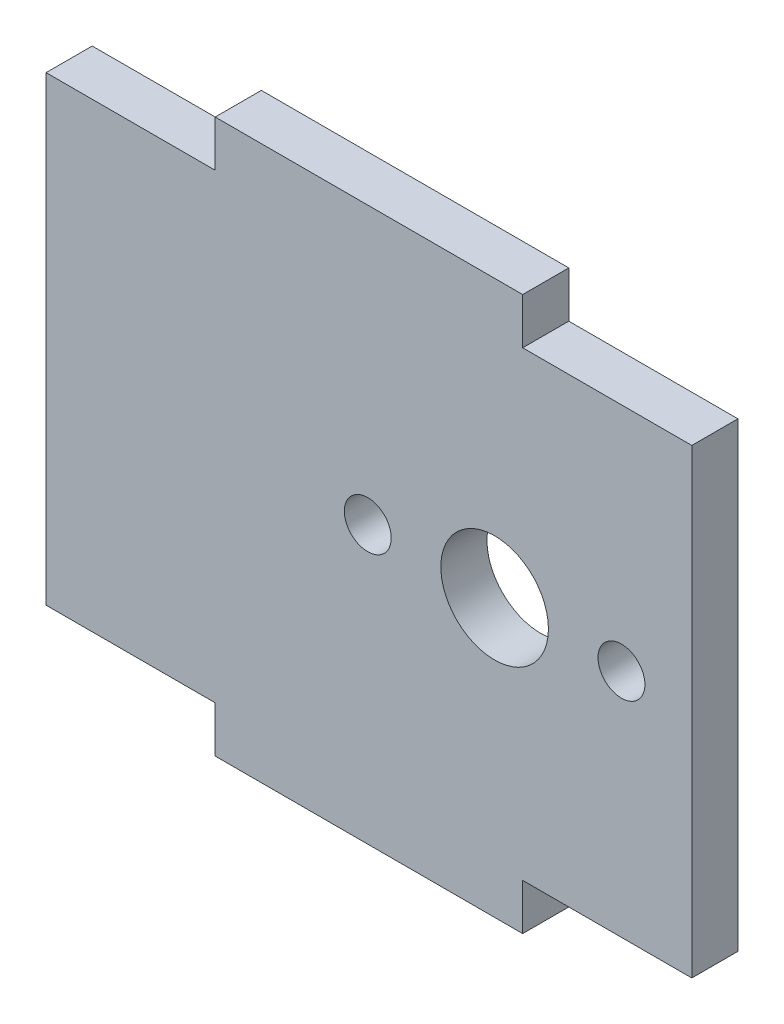
ISO-10303-21;
HEADER;
FILE_DESCRIPTION(('STEP AP214'),'2;1');
FILE_NAME('part.step','',(''),(''),'','','');
FILE_SCHEMA(('AUTOMOTIVE_DESIGN { 1 0 10303 214 1 1 1 1 }'));
ENDSEC;
DATA;
#1=APPLICATION_CONTEXT('core data for automotive mechanical design processes');
#2=APPLICATION_PROTOCOL_DEFINITION('international standard','automotive_design',2000,#1);
#3=PRODUCT_CONTEXT('',#1,'mechanical');
#4=PRODUCT('Part','Part','',(#3));
#5=PRODUCT_RELATED_PRODUCT_CATEGORY('part','',(#4));
#6=PRODUCT_DEFINITION_FORMATION('','',#4);
#7=PRODUCT_DEFINITION_CONTEXT('part definition',#1,'design');
#8=PRODUCT_DEFINITION('design','',#6,#7);
#9=PRODUCT_DEFINITION_SHAPE('','',#8);
#10=(LENGTH_UNIT() NAMED_UNIT(*) SI_UNIT(.MILLI.,.METRE.));
#11=(NAMED_UNIT(*) PLANE_ANGLE_UNIT() SI_UNIT($,.RADIAN.));
#12=(NAMED_UNIT(*) SI_UNIT($,.STERADIAN.) SOLID_ANGLE_UNIT());
#13=UNCERTAINTY_MEASURE_WITH_UNIT(LENGTH_MEASURE(1.E-05),#10,'distance_accuracy_value','');
#14=(GEOMETRIC_REPRESENTATION_CONTEXT(3) GLOBAL_UNCERTAINTY_ASSIGNED_CONTEXT((#13)) GLOBAL_UNIT_ASSIGNED_CONTEXT((#10,
#11,#12)) REPRESENTATION_CONTEXT('',''));
#15=CARTESIAN_POINT('',(0.,0.,0.));
#16=DIRECTION('',(0.,0.,1.));
#17=DIRECTION('',(1.,0.,0.));
#18=AXIS2_PLACEMENT_3D('',#15,#16,#17);
#19=CARTESIAN_POINT('',(21.,0.,3.));
#20=DIRECTION('',(1.,0.,0.));
#21=DIRECTION('',(0.,0.,-1.));
#22=AXIS2_PLACEMENT_3D('',#19,#20,#21);
#23=PLANE('',#22);
#24=DIRECTION('',(0.,-1.,0.));
#25=VECTOR('',#24,1.);
#26=CARTESIAN_POINT('',(21.,0.,0.));
#27=LINE('',#26,#25);
#28=CARTESIAN_POINT('',(21.,15.,0.));
#29=VERTEX_POINT('',#28);
#30=CARTESIAN_POINT('',(21.,-15.,0.));
#31=VERTEX_POINT('',#30);
#32=EDGE_CURVE('E156',#29,#31,#27,.T.);
#33=ORIENTED_EDGE('',*,*,#32,.F.);
#34=DIRECTION('',(0.,0.,-1.));
#35=VECTOR('',#34,1.);
#36=CARTESIAN_POINT('',(21.,15.,3.));
#37=LINE('',#36,#35);
#38=CARTESIAN_POINT('',(21.,15.,3.));
#39=VERTEX_POINT('',#38);
#40=EDGE_CURVE('E11',#39,#29,#37,.T.);
#41=ORIENTED_EDGE('',*,*,#40,.F.);
#42=DIRECTION('',(0.,-1.,0.));
#43=VECTOR('',#42,1.);
#44=CARTESIAN_POINT('',(21.,0.,3.));
#45=LINE('',#44,#43);
#46=CARTESIAN_POINT('',(21.,-15.,3.));
#47=VERTEX_POINT('',#46);
#48=EDGE_CURVE('E214',#39,#47,#45,.T.);
#49=ORIENTED_EDGE('',*,*,#48,.T.);
#50=DIRECTION('',(0.,0.,-1.));
#51=VECTOR('',#50,1.);
#52=CARTESIAN_POINT('',(21.,-15.,3.));
#53=LINE('',#52,#51);
#54=EDGE_CURVE('E100',#47,#31,#53,.T.);
#55=ORIENTED_EDGE('',*,*,#54,.T.);
#56=EDGE_LOOP('',(#33,#41,#49,#55));
#57=FACE_BOUND('',#56,.T.);
#58=ADVANCED_FACE('F38',(#57),#23,.T.);
#59=CARTESIAN_POINT('',(0.,15.,3.));
#60=DIRECTION('',(0.,1.,0.));
#61=DIRECTION('',(0.,0.,1.));
#62=AXIS2_PLACEMENT_3D('',#59,#60,#61);
#63=PLANE('',#62);
#64=DIRECTION('',(1.,0.,0.));
#65=VECTOR('',#64,1.);
#66=CARTESIAN_POINT('',(0.,15.,0.));
#67=LINE('',#66,#65);
#68=CARTESIAN_POINT('',(10.,15.,0.));
#69=VERTEX_POINT('',#68);
#70=EDGE_CURVE('E159',#69,#29,#67,.T.);
#71=ORIENTED_EDGE('',*,*,#70,.F.);
#72=DIRECTION('',(0.,0.,-1.));
#73=VECTOR('',#72,1.);
#74=CARTESIAN_POINT('',(10.,15.,3.));
#75=LINE('',#74,#73);
#76=CARTESIAN_POINT('',(10.,15.,3.));
#77=VERTEX_POINT('',#76);
#78=EDGE_CURVE('E46',#77,#69,#75,.T.);
#79=ORIENTED_EDGE('',*,*,#78,.F.);
#80=DIRECTION('',(1.,0.,0.));
#81=VECTOR('',#80,1.);
#82=CARTESIAN_POINT('',(0.,15.,3.));
#83=LINE('',#82,#81);
#84=EDGE_CURVE('E213',#77,#39,#83,.T.);
#85=ORIENTED_EDGE('',*,*,#84,.T.);
#86=ORIENTED_EDGE('',*,*,#40,.T.);
#87=EDGE_LOOP('',(#71,#79,#85,#86));
#88=FACE_BOUND('',#87,.T.);
#89=ADVANCED_FACE('F212',(#88),#63,.T.);
#90=CARTESIAN_POINT('',(9.99999999999996,0.,3.));
#91=DIRECTION('',(-1.,0.,0.));
#92=DIRECTION('',(0.,-1.,0.));
#93=AXIS2_PLACEMENT_3D('',#90,#91,#92);
#94=PLANE('',#93);
#95=DIRECTION('',(0.,1.,0.));
#96=VECTOR('',#95,1.);
#97=CARTESIAN_POINT('',(9.99999999999996,0.,0.));
#98=LINE('',#97,#96);
#99=CARTESIAN_POINT('',(10.,18.,0.));
#100=VERTEX_POINT('',#99);
#101=EDGE_CURVE('E163',#69,#100,#98,.T.);
#102=ORIENTED_EDGE('',*,*,#101,.T.);
#103=DIRECTION('',(0.,0.,-1.));
#104=VECTOR('',#103,1.);
#105=CARTESIAN_POINT('',(10.,18.,3.));
#106=LINE('',#105,#104);
#107=CARTESIAN_POINT('',(10.,18.,3.));
#108=VERTEX_POINT('',#107);
#109=EDGE_CURVE('E198',#108,#100,#106,.T.);
#110=ORIENTED_EDGE('',*,*,#109,.F.);
#111=DIRECTION('',(0.,1.,0.));
#112=VECTOR('',#111,1.);
#113=CARTESIAN_POINT('',(9.99999999999996,0.,3.));
#114=LINE('',#113,#112);
#115=EDGE_CURVE('E204',#77,#108,#114,.T.);
#116=ORIENTED_EDGE('',*,*,#115,.F.);
#117=ORIENTED_EDGE('',*,*,#78,.T.);
#118=EDGE_LOOP('',(#102,#110,#116,#117));
#119=FACE_BOUND('',#118,.T.);
#120=ADVANCED_FACE('F202',(#119),#94,.F.);
#121=CARTESIAN_POINT('',(0.,18.,3.));
#122=DIRECTION('',(0.,1.,0.));
#123=DIRECTION('',(0.,0.,1.));
#124=AXIS2_PLACEMENT_3D('',#121,#122,#123);
#125=PLANE('',#124);
#126=DIRECTION('',(1.,0.,0.));
#127=VECTOR('',#126,1.);
#128=CARTESIAN_POINT('',(0.,18.,0.));
#129=LINE('',#128,#127);
#130=CARTESIAN_POINT('',(-10.,18.,0.));
#131=VERTEX_POINT('',#130);
#132=EDGE_CURVE('E167',#131,#100,#129,.T.);
#133=ORIENTED_EDGE('',*,*,#132,.F.);
#134=DIRECTION('',(0.,0.,-1.));
#135=VECTOR('',#134,1.);
#136=CARTESIAN_POINT('',(-10.,18.,3.));
#137=LINE('',#136,#135);
#138=CARTESIAN_POINT('',(-10.,18.,3.));
#139=VERTEX_POINT('',#138);
#140=EDGE_CURVE('E196',#139,#131,#137,.T.);
#141=ORIENTED_EDGE('',*,*,#140,.F.);
#142=DIRECTION('',(1.,0.,0.));
#143=VECTOR('',#142,1.);
#144=CARTESIAN_POINT('',(0.,18.,3.));
#145=LINE('',#144,#143);
#146=EDGE_CURVE('E223',#139,#108,#145,.T.);
#147=ORIENTED_EDGE('',*,*,#146,.T.);
#148=ORIENTED_EDGE('',*,*,#109,.T.);
#149=EDGE_LOOP('',(#133,#141,#147,#148));
#150=FACE_BOUND('',#149,.T.);
#151=ADVANCED_FACE('F254',(#150),#125,.T.);
#152=CARTESIAN_POINT('',(-10.,0.,3.));
#153=DIRECTION('',(-1.,0.,0.));
#154=DIRECTION('',(0.,0.,1.));
#155=AXIS2_PLACEMENT_3D('',#152,#153,#154);
#156=PLANE('',#155);
#157=DIRECTION('',(0.,1.,0.));
#158=VECTOR('',#157,1.);
#159=CARTESIAN_POINT('',(-10.,0.,0.));
#160=LINE('',#159,#158);
#161=CARTESIAN_POINT('',(-10.,15.,0.));
#162=VERTEX_POINT('',#161);
#163=EDGE_CURVE('E170',#162,#131,#160,.T.);
#164=ORIENTED_EDGE('',*,*,#163,.F.);
#165=DIRECTION('',(0.,0.,-1.));
#166=VECTOR('',#165,1.);
#167=CARTESIAN_POINT('',(-10.,15.,3.));
#168=LINE('',#167,#166);
#169=CARTESIAN_POINT('',(-10.,15.,3.));
#170=VERTEX_POINT('',#169);
#171=EDGE_CURVE('E194',#170,#162,#168,.T.);
#172=ORIENTED_EDGE('',*,*,#171,.F.);
#173=DIRECTION('',(0.,1.,0.));
#174=VECTOR('',#173,1.);
#175=CARTESIAN_POINT('',(-10.,0.,3.));
#176=LINE('',#175,#174);
#177=EDGE_CURVE('E226',#170,#139,#176,.T.);
#178=ORIENTED_EDGE('',*,*,#177,.T.);
#179=ORIENTED_EDGE('',*,*,#140,.T.);
#180=EDGE_LOOP('',(#164,#172,#178,#179));
#181=FACE_BOUND('',#180,.T.);
#182=ADVANCED_FACE('F251',(#181),#156,.T.);
#183=CARTESIAN_POINT('',(-21.,15.,0.));
#184=VERTEX_POINT('',#183);
#185=EDGE_CURVE('E164',#184,#162,#67,.T.);
#186=ORIENTED_EDGE('',*,*,#185,.F.);
#187=DIRECTION('',(0.,0.,-1.));
#188=VECTOR('',#187,1.);
#189=CARTESIAN_POINT('',(-21.,15.,3.));
#190=LINE('',#189,#188);
#191=CARTESIAN_POINT('',(-21.,15.,3.));
#192=VERTEX_POINT('',#191);
#193=EDGE_CURVE('E192',#192,#184,#190,.T.);
#194=ORIENTED_EDGE('',*,*,#193,.F.);
#195=EDGE_CURVE('E217',#192,#170,#83,.T.);
#196=ORIENTED_EDGE('',*,*,#195,.T.);
#197=ORIENTED_EDGE('',*,*,#171,.T.);
#198=EDGE_LOOP('',(#186,#194,#196,#197));
#199=FACE_BOUND('',#198,.T.);
#200=ADVANCED_FACE('F246',(#199),#63,.T.);
#201=CARTESIAN_POINT('',(-21.,0.,3.));
#202=DIRECTION('',(1.,0.,0.));
#203=DIRECTION('',(0.,1.,0.));
#204=AXIS2_PLACEMENT_3D('',#201,#202,#203);
#205=PLANE('',#204);
#206=DIRECTION('',(0.,-1.,0.));
#207=VECTOR('',#206,1.);
#208=CARTESIAN_POINT('',(-21.,0.,0.));
#209=LINE('',#208,#207);
#210=CARTESIAN_POINT('',(-21.,-15.,0.));
#211=VERTEX_POINT('',#210);
#212=EDGE_CURVE('E173',#184,#211,#209,.T.);
#213=ORIENTED_EDGE('',*,*,#212,.T.);
#214=DIRECTION('',(0.,0.,-1.));
#215=VECTOR('',#214,1.);
#216=CARTESIAN_POINT('',(-21.,-15.,3.));
#217=LINE('',#216,#215);
#218=CARTESIAN_POINT('',(-21.,-15.,3.));
#219=VERTEX_POINT('',#218);
#220=EDGE_CURVE('E189',#219,#211,#217,.T.);
#221=ORIENTED_EDGE('',*,*,#220,.F.);
#222=DIRECTION('',(0.,-1.,0.));
#223=VECTOR('',#222,1.);
#224=CARTESIAN_POINT('',(-21.,0.,3.));
#225=LINE('',#224,#223);
#226=EDGE_CURVE('E229',#192,#219,#225,.T.);
#227=ORIENTED_EDGE('',*,*,#226,.F.);
#228=ORIENTED_EDGE('',*,*,#193,.T.);
#229=EDGE_LOOP('',(#213,#221,#227,#228));
#230=FACE_BOUND('',#229,.T.);
#231=ADVANCED_FACE('F271',(#230),#205,.F.);
#232=CARTESIAN_POINT('',(0.,-15.,3.));
#233=DIRECTION('',(0.,1.,0.));
#234=DIRECTION('',(0.,0.,1.));
#235=AXIS2_PLACEMENT_3D('',#232,#233,#234);
#236=PLANE('',#235);
#237=DIRECTION('',(1.,0.,0.));
#238=VECTOR('',#237,1.);
#239=CARTESIAN_POINT('',(0.,-15.,0.));
#240=LINE('',#239,#238);
#241=CARTESIAN_POINT('',(-10.,-15.,0.));
#242=VERTEX_POINT('',#241);
#243=EDGE_CURVE('E175',#211,#242,#240,.T.);
#244=ORIENTED_EDGE('',*,*,#243,.T.);
#245=DIRECTION('',(0.,0.,-1.));
#246=VECTOR('',#245,1.);
#247=CARTESIAN_POINT('',(-10.,-15.,3.));
#248=LINE('',#247,#246);
#249=CARTESIAN_POINT('',(-10.,-15.,3.));
#250=VERTEX_POINT('',#249);
#251=EDGE_CURVE('E186',#250,#242,#248,.T.);
#252=ORIENTED_EDGE('',*,*,#251,.F.);
#253=DIRECTION('',(1.,0.,0.));
#254=VECTOR('',#253,1.);
#255=CARTESIAN_POINT('',(0.,-15.,3.));
#256=LINE('',#255,#254);
#257=EDGE_CURVE('E153',#219,#250,#256,.T.);
#258=ORIENTED_EDGE('',*,*,#257,.F.);
#259=ORIENTED_EDGE('',*,*,#220,.T.);
#260=EDGE_LOOP('',(#244,#252,#258,#259));
#261=FACE_BOUND('',#260,.T.);
#262=ADVANCED_FACE('F236',(#261),#236,.F.);
#263=CARTESIAN_POINT('',(-10.,0.,3.));
#264=DIRECTION('',(1.,0.,0.));
#265=DIRECTION('',(0.,0.,-1.));
#266=AXIS2_PLACEMENT_3D('',#263,#264,#265);
#267=PLANE('',#266);
#268=DIRECTION('',(0.,-1.,0.));
#269=VECTOR('',#268,1.);
#270=CARTESIAN_POINT('',(-10.,0.,0.));
#271=LINE('',#270,#269);
#272=CARTESIAN_POINT('',(-10.,-18.,0.));
#273=VERTEX_POINT('',#272);
#274=EDGE_CURVE('E177',#242,#273,#271,.T.);
#275=ORIENTED_EDGE('',*,*,#274,.T.);
#276=DIRECTION('',(0.,0.,-1.));
#277=VECTOR('',#276,1.);
#278=CARTESIAN_POINT('',(-10.,-18.,3.));
#279=LINE('',#278,#277);
#280=CARTESIAN_POINT('',(-10.,-18.,3.));
#281=VERTEX_POINT('',#280);
#282=EDGE_CURVE('E148',#281,#273,#279,.T.);
#283=ORIENTED_EDGE('',*,*,#282,.F.);
#284=DIRECTION('',(0.,-1.,0.));
#285=VECTOR('',#284,1.);
#286=CARTESIAN_POINT('',(-10.,0.,3.));
#287=LINE('',#286,#285);
#288=EDGE_CURVE('E135',#250,#281,#287,.T.);
#289=ORIENTED_EDGE('',*,*,#288,.F.);
#290=ORIENTED_EDGE('',*,*,#251,.T.);
#291=EDGE_LOOP('',(#275,#283,#289,#290));
#292=FACE_BOUND('',#291,.T.);
#293=ADVANCED_FACE('F240',(#292),#267,.F.);
#294=CARTESIAN_POINT('',(0.,-18.,3.));
#295=DIRECTION('',(0.,1.,0.));
#296=DIRECTION('',(0.,0.,1.));
#297=AXIS2_PLACEMENT_3D('',#294,#295,#296);
#298=PLANE('',#297);
#299=DIRECTION('',(1.,0.,0.));
#300=VECTOR('',#299,1.);
#301=CARTESIAN_POINT('',(0.,-18.,0.));
#302=LINE('',#301,#300);
#303=CARTESIAN_POINT('',(10.,-18.,0.));
#304=VERTEX_POINT('',#303);
#305=EDGE_CURVE('E144',#273,#304,#302,.T.);
#306=ORIENTED_EDGE('',*,*,#305,.T.);
#307=DIRECTION('',(0.,0.,-1.));
#308=VECTOR('',#307,1.);
#309=CARTESIAN_POINT('',(10.,-18.,3.));
#310=LINE('',#309,#308);
#311=CARTESIAN_POINT('',(10.,-18.,3.));
#312=VERTEX_POINT('',#311);
#313=EDGE_CURVE('E141',#312,#304,#310,.T.);
#314=ORIENTED_EDGE('',*,*,#313,.F.);
#315=DIRECTION('',(1.,0.,0.));
#316=VECTOR('',#315,1.);
#317=CARTESIAN_POINT('',(0.,-18.,3.));
#318=LINE('',#317,#316);
#319=EDGE_CURVE('E129',#281,#312,#318,.T.);
#320=ORIENTED_EDGE('',*,*,#319,.F.);
#321=ORIENTED_EDGE('',*,*,#282,.T.);
#322=EDGE_LOOP('',(#306,#314,#320,#321));
#323=FACE_BOUND('',#322,.T.);
#324=ADVANCED_FACE('F142',(#323),#298,.F.);
#325=CARTESIAN_POINT('',(10.,0.,3.));
#326=DIRECTION('',(1.,0.,0.));
#327=DIRECTION('',(0.,0.,-1.));
#328=AXIS2_PLACEMENT_3D('',#325,#326,#327);
#329=PLANE('',#328);
#330=DIRECTION('',(0.,-1.,0.));
#331=VECTOR('',#330,1.);
#332=CARTESIAN_POINT('',(10.,0.,0.));
#333=LINE('',#332,#331);
#334=CARTESIAN_POINT('',(10.,-15.,0.));
#335=VERTEX_POINT('',#334);
#336=EDGE_CURVE('E181',#335,#304,#333,.T.);
#337=ORIENTED_EDGE('',*,*,#336,.F.);
#338=DIRECTION('',(0.,0.,-1.));
#339=VECTOR('',#338,1.);
#340=CARTESIAN_POINT('',(10.,-15.,3.));
#341=LINE('',#340,#339);
#342=CARTESIAN_POINT('',(10.,-15.,3.));
#343=VERTEX_POINT('',#342);
#344=EDGE_CURVE('E93',#343,#335,#341,.T.);
#345=ORIENTED_EDGE('',*,*,#344,.F.);
#346=DIRECTION('',(0.,-1.,0.));
#347=VECTOR('',#346,1.);
#348=CARTESIAN_POINT('',(10.,0.,3.));
#349=LINE('',#348,#347);
#350=EDGE_CURVE('E133',#343,#312,#349,.T.);
#351=ORIENTED_EDGE('',*,*,#350,.T.);
#352=ORIENTED_EDGE('',*,*,#313,.T.);
#353=EDGE_LOOP('',(#337,#345,#351,#352));
#354=FACE_BOUND('',#353,.T.);
#355=ADVANCED_FACE('F150',(#354),#329,.T.);
#356=EDGE_CURVE('E178',#335,#31,#240,.T.);
#357=ORIENTED_EDGE('',*,*,#356,.T.);
#358=ORIENTED_EDGE('',*,*,#54,.F.);
#359=EDGE_CURVE('E54',#343,#47,#256,.T.);
#360=ORIENTED_EDGE('',*,*,#359,.F.);
#361=ORIENTED_EDGE('',*,*,#344,.T.);
#362=EDGE_LOOP('',(#357,#358,#360,#361));
#363=FACE_BOUND('',#362,.T.);
#364=ADVANCED_FACE('F279',(#363),#236,.F.);
#365=CARTESIAN_POINT('',(0.,0.,3.));
#366=DIRECTION('',(0.,0.,1.));
#367=DIRECTION('',(1.,0.,0.));
#368=AXIS2_PLACEMENT_3D('',#365,#366,#367);
#369=PLANE('',#368);
#370=CARTESIAN_POINT('',(-0.0749999999999952,0.,3.));
#371=DIRECTION('',(0.,0.,1.));
#372=DIRECTION('',(1.,0.,0.));
#373=AXIS2_PLACEMENT_3D('',#370,#371,#372);
#374=CIRCLE('',#373,1.525);
#375=CARTESIAN_POINT('',(1.45000000000001,0.,3.));
#376=VERTEX_POINT('',#375);
#377=EDGE_CURVE('E319',#376,#376,#374,.T.);
#378=ORIENTED_EDGE('',*,*,#377,.F.);
#379=EDGE_LOOP('',(#378));
#380=FACE_BOUND('',#379,.T.);
#381=CARTESIAN_POINT('',(16.425,0.,3.));
#382=DIRECTION('',(0.,0.,1.));
#383=DIRECTION('',(1.,0.,0.));
#384=AXIS2_PLACEMENT_3D('',#381,#382,#383);
#385=CIRCLE('',#384,1.525);
#386=CARTESIAN_POINT('',(17.95,0.,3.));
#387=VERTEX_POINT('',#386);
#388=EDGE_CURVE('E313',#387,#387,#385,.T.);
#389=ORIENTED_EDGE('',*,*,#388,.F.);
#390=EDGE_LOOP('',(#389));
#391=FACE_BOUND('',#390,.T.);
#392=CARTESIAN_POINT('',(8.17500000000001,0.,3.));
#393=DIRECTION('',(0.,0.,1.));
#394=DIRECTION('',(1.,0.,0.));
#395=AXIS2_PLACEMENT_3D('',#392,#393,#394);
#396=CIRCLE('',#395,3.5);
#397=CARTESIAN_POINT('',(11.675,0.,3.));
#398=VERTEX_POINT('',#397);
#399=EDGE_CURVE('E219',#398,#398,#396,.T.);
#400=ORIENTED_EDGE('',*,*,#399,.F.);
#401=EDGE_LOOP('',(#400));
#402=FACE_BOUND('',#401,.T.);
#403=ORIENTED_EDGE('',*,*,#48,.F.);
#404=ORIENTED_EDGE('',*,*,#84,.F.);
#405=ORIENTED_EDGE('',*,*,#115,.T.);
#406=ORIENTED_EDGE('',*,*,#146,.F.);
#407=ORIENTED_EDGE('',*,*,#177,.F.);
#408=ORIENTED_EDGE('',*,*,#195,.F.);
#409=ORIENTED_EDGE('',*,*,#226,.T.);
#410=ORIENTED_EDGE('',*,*,#257,.T.);
#411=ORIENTED_EDGE('',*,*,#288,.T.);
#412=ORIENTED_EDGE('',*,*,#319,.T.);
#413=ORIENTED_EDGE('',*,*,#350,.F.);
#414=ORIENTED_EDGE('',*,*,#359,.T.);
#415=EDGE_LOOP('',(#403,#404,#405,#406,#407,#408,#409,#410,#411,#412,#413,#414));
#416=FACE_BOUND('',#415,.T.);
#417=ADVANCED_FACE('F131',(#380,#391,#402,#416),#369,.T.);
#418=CARTESIAN_POINT('',(0.,0.,0.));
#419=DIRECTION('',(0.,0.,1.));
#420=DIRECTION('',(1.,0.,0.));
#421=AXIS2_PLACEMENT_3D('',#418,#419,#420);
#422=PLANE('',#421);
#423=CARTESIAN_POINT('',(-0.0749999999999952,0.,0.));
#424=DIRECTION('',(0.,0.,1.));
#425=DIRECTION('',(1.,0.,0.));
#426=AXIS2_PLACEMENT_3D('',#423,#424,#425);
#427=CIRCLE('',#426,1.525);
#428=CARTESIAN_POINT('',(1.45000000000001,0.,0.));
#429=VERTEX_POINT('',#428);
#430=EDGE_CURVE('E315',#429,#429,#427,.T.);
#431=ORIENTED_EDGE('',*,*,#430,.T.);
#432=EDGE_LOOP('',(#431));
#433=FACE_BOUND('',#432,.T.);
#434=CARTESIAN_POINT('',(16.425,0.,0.));
#435=DIRECTION('',(0.,0.,1.));
#436=DIRECTION('',(1.,0.,0.));
#437=AXIS2_PLACEMENT_3D('',#434,#435,#436);
#438=CIRCLE('',#437,1.525);
#439=CARTESIAN_POINT('',(17.95,0.,0.));
#440=VERTEX_POINT('',#439);
#441=EDGE_CURVE('E310',#440,#440,#438,.T.);
#442=ORIENTED_EDGE('',*,*,#441,.T.);
#443=EDGE_LOOP('',(#442));
#444=FACE_BOUND('',#443,.T.);
#445=CARTESIAN_POINT('',(8.17500000000001,0.,0.));
#446=DIRECTION('',(0.,0.,1.));
#447=DIRECTION('',(1.,0.,0.));
#448=AXIS2_PLACEMENT_3D('',#445,#446,#447);
#449=CIRCLE('',#448,3.5);
#450=CARTESIAN_POINT('',(11.675,0.,0.));
#451=VERTEX_POINT('',#450);
#452=EDGE_CURVE('E160',#451,#451,#449,.T.);
#453=ORIENTED_EDGE('',*,*,#452,.T.);
#454=EDGE_LOOP('',(#453));
#455=FACE_BOUND('',#454,.T.);
#456=ORIENTED_EDGE('',*,*,#32,.T.);
#457=ORIENTED_EDGE('',*,*,#356,.F.);
#458=ORIENTED_EDGE('',*,*,#336,.T.);
#459=ORIENTED_EDGE('',*,*,#305,.F.);
#460=ORIENTED_EDGE('',*,*,#274,.F.);
#461=ORIENTED_EDGE('',*,*,#243,.F.);
#462=ORIENTED_EDGE('',*,*,#212,.F.);
#463=ORIENTED_EDGE('',*,*,#185,.T.);
#464=ORIENTED_EDGE('',*,*,#163,.T.);
#465=ORIENTED_EDGE('',*,*,#132,.T.);
#466=ORIENTED_EDGE('',*,*,#101,.F.);
#467=ORIENTED_EDGE('',*,*,#70,.T.);
#468=EDGE_LOOP('',(#456,#457,#458,#459,#460,#461,#462,#463,#464,#465,#466,#467));
#469=FACE_BOUND('',#468,.T.);
#470=ADVANCED_FACE('F210',(#433,#444,#455,#469),#422,.F.);
#471=CARTESIAN_POINT('',(8.17500000000001,0.,0.));
#472=DIRECTION('',(0.,0.,1.));
#473=DIRECTION('',(1.,0.,0.));
#474=AXIS2_PLACEMENT_3D('',#471,#472,#473);
#475=CYLINDRICAL_SURFACE('',#474,3.5);
#476=ORIENTED_EDGE('',*,*,#452,.F.);
#477=EDGE_LOOP('',(#476));
#478=FACE_BOUND('',#477,.T.);
#479=ORIENTED_EDGE('',*,*,#399,.T.);
#480=EDGE_LOOP('',(#479));
#481=FACE_BOUND('',#480,.T.);
#482=ADVANCED_FACE('F290',(#478,#481),#475,.F.);
#483=CARTESIAN_POINT('',(16.425,0.,0.));
#484=DIRECTION('',(0.,0.,1.));
#485=DIRECTION('',(1.,0.,0.));
#486=AXIS2_PLACEMENT_3D('',#483,#484,#485);
#487=CYLINDRICAL_SURFACE('',#486,1.525);
#488=ORIENTED_EDGE('',*,*,#441,.F.);
#489=EDGE_LOOP('',(#488));
#490=FACE_BOUND('',#489,.T.);
#491=ORIENTED_EDGE('',*,*,#388,.T.);
#492=EDGE_LOOP('',(#491));
#493=FACE_BOUND('',#492,.T.);
#494=ADVANCED_FACE('F297',(#490,#493),#487,.F.);
#495=CARTESIAN_POINT('',(-0.0749999999999952,0.,0.));
#496=DIRECTION('',(0.,0.,1.));
#497=DIRECTION('',(1.,0.,0.));
#498=AXIS2_PLACEMENT_3D('',#495,#496,#497);
#499=CYLINDRICAL_SURFACE('',#498,1.525);
#500=ORIENTED_EDGE('',*,*,#430,.F.);
#501=EDGE_LOOP('',(#500));
#502=FACE_BOUND('',#501,.T.);
#503=ORIENTED_EDGE('',*,*,#377,.T.);
#504=EDGE_LOOP('',(#503));
#505=FACE_BOUND('',#504,.T.);
#506=ADVANCED_FACE('F299',(#502,#505),#499,.F.);
#507=CLOSED_SHELL('',(#58,#89,#120,#151,#182,#200,#231,#262,#293,#324,#355,#364,#417,#470,#482,
#494,#506));
#508=MANIFOLD_SOLID_BREP('B2',#507);
#509=ADVANCED_BREP_SHAPE_REPRESENTATION('',(#18,#508),#14);
#510=SHAPE_DEFINITION_REPRESENTATION(#9,#509);
ENDSEC;
END-ISO-10303-21;
